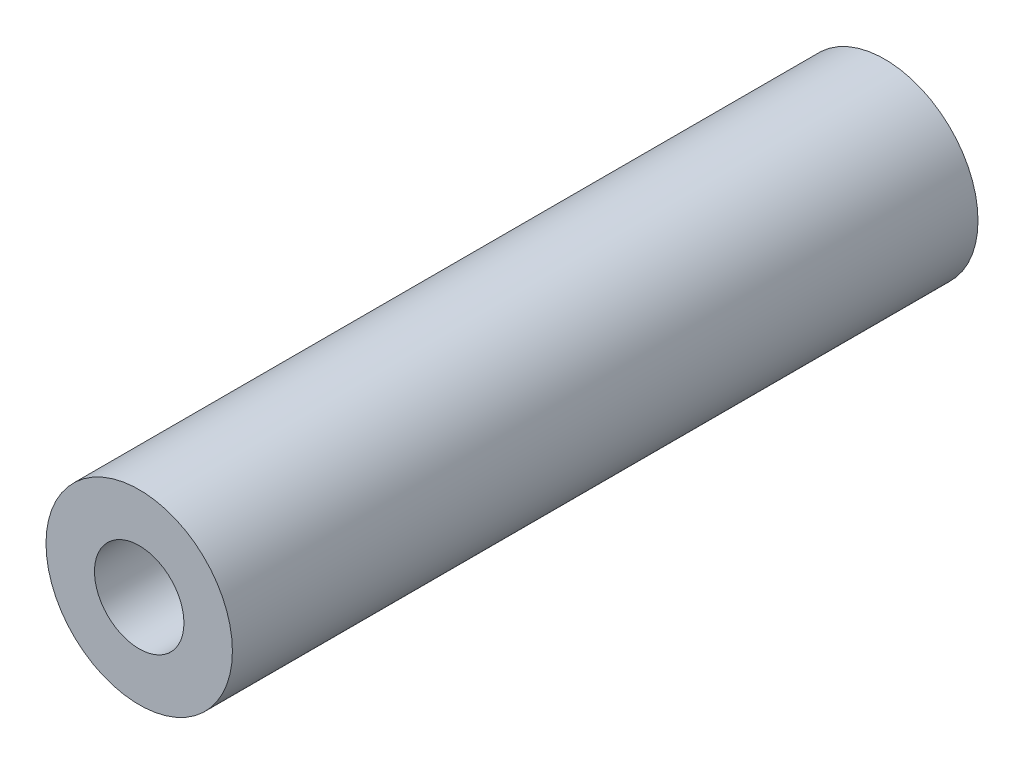
ISO-10303-21;
HEADER;
FILE_DESCRIPTION(('STEP AP214'),'2;1');
FILE_NAME('part.step','',(''),(''),'','','');
FILE_SCHEMA(('AUTOMOTIVE_DESIGN { 1 0 10303 214 1 1 1 1 }'));
ENDSEC;
DATA;
#1=APPLICATION_CONTEXT('core data for automotive mechanical design processes');
#2=APPLICATION_PROTOCOL_DEFINITION('international standard','automotive_design',2000,#1);
#3=PRODUCT_CONTEXT('',#1,'mechanical');
#4=PRODUCT('Part','Part','',(#3));
#5=PRODUCT_RELATED_PRODUCT_CATEGORY('part','',(#4));
#6=PRODUCT_DEFINITION_FORMATION('','',#4);
#7=PRODUCT_DEFINITION_CONTEXT('part definition',#1,'design');
#8=PRODUCT_DEFINITION('design','',#6,#7);
#9=PRODUCT_DEFINITION_SHAPE('','',#8);
#10=(LENGTH_UNIT() NAMED_UNIT(*) SI_UNIT(.MILLI.,.METRE.));
#11=(NAMED_UNIT(*) PLANE_ANGLE_UNIT() SI_UNIT($,.RADIAN.));
#12=(NAMED_UNIT(*) SI_UNIT($,.STERADIAN.) SOLID_ANGLE_UNIT());
#13=UNCERTAINTY_MEASURE_WITH_UNIT(LENGTH_MEASURE(1.E-05),#10,'distance_accuracy_value','');
#14=(GEOMETRIC_REPRESENTATION_CONTEXT(3) GLOBAL_UNCERTAINTY_ASSIGNED_CONTEXT((#13)) GLOBAL_UNIT_ASSIGNED_CONTEXT((#10,
#11,#12)) REPRESENTATION_CONTEXT('',''));
#15=CARTESIAN_POINT('',(0.,0.,0.));
#16=DIRECTION('',(0.,0.,1.));
#17=DIRECTION('',(1.,0.,0.));
#18=AXIS2_PLACEMENT_3D('',#15,#16,#17);
#19=CARTESIAN_POINT('',(0.,0.,25.4));
#20=DIRECTION('',(0.,0.,1.));
#21=DIRECTION('',(1.,0.,0.));
#22=AXIS2_PLACEMENT_3D('',#19,#20,#21);
#23=PLANE('',#22);
#24=CARTESIAN_POINT('',(0.,0.,25.4));
#25=DIRECTION('',(0.,0.,1.));
#26=DIRECTION('',(1.,0.,0.));
#27=AXIS2_PLACEMENT_3D('',#24,#25,#26);
#28=CIRCLE('',#27,3.175);
#29=CARTESIAN_POINT('',(3.175,0.,25.4));
#30=VERTEX_POINT('',#29);
#31=EDGE_CURVE('E10',#30,#30,#28,.T.);
#32=ORIENTED_EDGE('',*,*,#31,.T.);
#33=EDGE_LOOP('',(#32));
#34=FACE_BOUND('',#33,.T.);
#35=CARTESIAN_POINT('',(0.,0.,25.4));
#36=DIRECTION('',(0.,0.,1.));
#37=DIRECTION('',(1.,0.,0.));
#38=AXIS2_PLACEMENT_3D('',#35,#36,#37);
#39=CIRCLE('',#38,1.524);
#40=CARTESIAN_POINT('',(1.524,0.,25.4));
#41=VERTEX_POINT('',#40);
#42=EDGE_CURVE('E40',#41,#41,#39,.T.);
#43=ORIENTED_EDGE('',*,*,#42,.F.);
#44=EDGE_LOOP('',(#43));
#45=FACE_BOUND('',#44,.T.);
#46=ADVANCED_FACE('F29',(#34,#45),#23,.T.);
#47=CARTESIAN_POINT('',(0.,0.,0.));
#48=DIRECTION('',(0.,0.,1.));
#49=DIRECTION('',(1.,0.,0.));
#50=AXIS2_PLACEMENT_3D('',#47,#48,#49);
#51=PLANE('',#50);
#52=CARTESIAN_POINT('',(0.,0.,0.));
#53=DIRECTION('',(0.,0.,1.));
#54=DIRECTION('',(1.,0.,0.));
#55=AXIS2_PLACEMENT_3D('',#52,#53,#54);
#56=CIRCLE('',#55,3.175);
#57=CARTESIAN_POINT('',(3.175,0.,0.));
#58=VERTEX_POINT('',#57);
#59=EDGE_CURVE('E33',#58,#58,#56,.T.);
#60=ORIENTED_EDGE('',*,*,#59,.F.);
#61=EDGE_LOOP('',(#60));
#62=FACE_BOUND('',#61,.T.);
#63=CARTESIAN_POINT('',(0.,0.,0.));
#64=DIRECTION('',(0.,0.,1.));
#65=DIRECTION('',(1.,0.,0.));
#66=AXIS2_PLACEMENT_3D('',#63,#64,#65);
#67=CIRCLE('',#66,1.524);
#68=CARTESIAN_POINT('',(1.524,0.,0.));
#69=VERTEX_POINT('',#68);
#70=EDGE_CURVE('E42',#69,#69,#67,.T.);
#71=ORIENTED_EDGE('',*,*,#70,.T.);
#72=EDGE_LOOP('',(#71));
#73=FACE_BOUND('',#72,.T.);
#74=ADVANCED_FACE('F52',(#62,#73),#51,.F.);
#75=CARTESIAN_POINT('',(0.,0.,25.4));
#76=DIRECTION('',(0.,0.,-1.));
#77=DIRECTION('',(-1.,0.,0.));
#78=AXIS2_PLACEMENT_3D('',#75,#76,#77);
#79=CYLINDRICAL_SURFACE('',#78,3.175);
#80=ORIENTED_EDGE('',*,*,#31,.F.);
#81=EDGE_LOOP('',(#80));
#82=FACE_BOUND('',#81,.T.);
#83=ORIENTED_EDGE('',*,*,#59,.T.);
#84=EDGE_LOOP('',(#83));
#85=FACE_BOUND('',#84,.T.);
#86=ADVANCED_FACE('F31',(#82,#85),#79,.T.);
#87=CARTESIAN_POINT('',(0.,0.,25.4));
#88=DIRECTION('',(0.,0.,-1.));
#89=DIRECTION('',(-1.,0.,0.));
#90=AXIS2_PLACEMENT_3D('',#87,#88,#89);
#91=CYLINDRICAL_SURFACE('',#90,1.524);
#92=ORIENTED_EDGE('',*,*,#42,.T.);
#93=EDGE_LOOP('',(#92));
#94=FACE_BOUND('',#93,.T.);
#95=ORIENTED_EDGE('',*,*,#70,.F.);
#96=EDGE_LOOP('',(#95));
#97=FACE_BOUND('',#96,.T.);
#98=ADVANCED_FACE('F48',(#94,#97),#91,.F.);
#99=CLOSED_SHELL('',(#46,#74,#86,#98));
#100=MANIFOLD_SOLID_BREP('B2',#99);
#101=ADVANCED_BREP_SHAPE_REPRESENTATION('',(#18,#100),#14);
#102=SHAPE_DEFINITION_REPRESENTATION(#9,#101);
ENDSEC;
END-ISO-10303-21;
